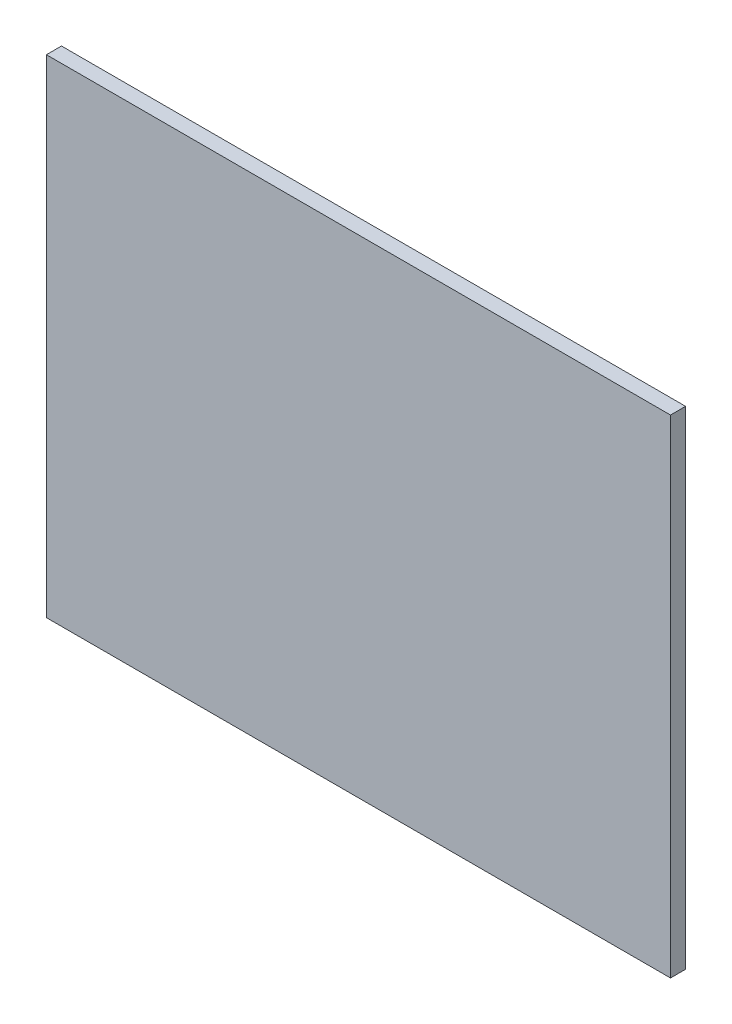
ISO-10303-21;
HEADER;
FILE_DESCRIPTION(('STEP AP214'),'2;1');
FILE_NAME('part.step','',(''),(''),'','','');
FILE_SCHEMA(('AUTOMOTIVE_DESIGN { 1 0 10303 214 1 1 1 1 }'));
ENDSEC;
DATA;
#1=APPLICATION_CONTEXT('core data for automotive mechanical design processes');
#2=APPLICATION_PROTOCOL_DEFINITION('international standard','automotive_design',2000,#1);
#3=PRODUCT_CONTEXT('',#1,'mechanical');
#4=PRODUCT('Part','Part','',(#3));
#5=PRODUCT_RELATED_PRODUCT_CATEGORY('part','',(#4));
#6=PRODUCT_DEFINITION_FORMATION('','',#4);
#7=PRODUCT_DEFINITION_CONTEXT('part definition',#1,'design');
#8=PRODUCT_DEFINITION('design','',#6,#7);
#9=PRODUCT_DEFINITION_SHAPE('','',#8);
#10=(LENGTH_UNIT() NAMED_UNIT(*) SI_UNIT(.MILLI.,.METRE.));
#11=(NAMED_UNIT(*) PLANE_ANGLE_UNIT() SI_UNIT($,.RADIAN.));
#12=(NAMED_UNIT(*) SI_UNIT($,.STERADIAN.) SOLID_ANGLE_UNIT());
#13=UNCERTAINTY_MEASURE_WITH_UNIT(LENGTH_MEASURE(1.E-05),#10,'distance_accuracy_value','');
#14=(GEOMETRIC_REPRESENTATION_CONTEXT(3) GLOBAL_UNCERTAINTY_ASSIGNED_CONTEXT((#13)) GLOBAL_UNIT_ASSIGNED_CONTEXT((#10,
#11,#12)) REPRESENTATION_CONTEXT('',''));
#15=CARTESIAN_POINT('',(0.,0.,0.));
#16=DIRECTION('',(0.,0.,1.));
#17=DIRECTION('',(1.,0.,0.));
#18=AXIS2_PLACEMENT_3D('',#15,#16,#17);
#19=CARTESIAN_POINT('',(-372.5,-291.,18.));
#20=DIRECTION('',(1.,0.,0.));
#21=DIRECTION('',(0.,0.,-1.));
#22=AXIS2_PLACEMENT_3D('',#19,#20,#21);
#23=PLANE('',#22);
#24=DIRECTION('',(0.,-1.,0.));
#25=VECTOR('',#24,1.);
#26=CARTESIAN_POINT('',(-372.5,-291.,0.));
#27=LINE('',#26,#25);
#28=CARTESIAN_POINT('',(-372.5,291.,0.));
#29=VERTEX_POINT('',#28);
#30=CARTESIAN_POINT('',(-372.5,-291.,0.));
#31=VERTEX_POINT('',#30);
#32=EDGE_CURVE('E96',#29,#31,#27,.T.);
#33=ORIENTED_EDGE('',*,*,#32,.T.);
#34=DIRECTION('',(0.,0.,-1.));
#35=VECTOR('',#34,1.);
#36=CARTESIAN_POINT('',(-372.5,-291.,18.));
#37=LINE('',#36,#35);
#38=CARTESIAN_POINT('',(-372.5,-291.,18.));
#39=VERTEX_POINT('',#38);
#40=EDGE_CURVE('E11',#39,#31,#37,.T.);
#41=ORIENTED_EDGE('',*,*,#40,.F.);
#42=DIRECTION('',(0.,-1.,0.));
#43=VECTOR('',#42,1.);
#44=CARTESIAN_POINT('',(-372.5,-291.,18.));
#45=LINE('',#44,#43);
#46=CARTESIAN_POINT('',(-372.5,291.,18.));
#47=VERTEX_POINT('',#46);
#48=EDGE_CURVE('E84',#47,#39,#45,.T.);
#49=ORIENTED_EDGE('',*,*,#48,.F.);
#50=DIRECTION('',(0.,0.,-1.));
#51=VECTOR('',#50,1.);
#52=CARTESIAN_POINT('',(-372.5,291.,18.));
#53=LINE('',#52,#51);
#54=EDGE_CURVE('E92',#47,#29,#53,.T.);
#55=ORIENTED_EDGE('',*,*,#54,.T.);
#56=EDGE_LOOP('',(#33,#41,#49,#55));
#57=FACE_BOUND('',#56,.T.);
#58=ADVANCED_FACE('F33',(#57),#23,.F.);
#59=CARTESIAN_POINT('',(372.5,-291.,18.));
#60=DIRECTION('',(0.,1.,0.));
#61=DIRECTION('',(-1.,0.,0.));
#62=AXIS2_PLACEMENT_3D('',#59,#60,#61);
#63=PLANE('',#62);
#64=DIRECTION('',(1.,0.,0.));
#65=VECTOR('',#64,1.);
#66=CARTESIAN_POINT('',(372.5,-291.,0.));
#67=LINE('',#66,#65);
#68=CARTESIAN_POINT('',(372.5,-291.,0.));
#69=VERTEX_POINT('',#68);
#70=EDGE_CURVE('E88',#31,#69,#67,.T.);
#71=ORIENTED_EDGE('',*,*,#70,.T.);
#72=DIRECTION('',(0.,0.,-1.));
#73=VECTOR('',#72,1.);
#74=CARTESIAN_POINT('',(372.5,-291.,18.));
#75=LINE('',#74,#73);
#76=CARTESIAN_POINT('',(372.5,-291.,18.));
#77=VERTEX_POINT('',#76);
#78=EDGE_CURVE('E41',#77,#69,#75,.T.);
#79=ORIENTED_EDGE('',*,*,#78,.F.);
#80=DIRECTION('',(1.,0.,0.));
#81=VECTOR('',#80,1.);
#82=CARTESIAN_POINT('',(372.5,-291.,18.));
#83=LINE('',#82,#81);
#84=EDGE_CURVE('E79',#39,#77,#83,.T.);
#85=ORIENTED_EDGE('',*,*,#84,.F.);
#86=ORIENTED_EDGE('',*,*,#40,.T.);
#87=EDGE_LOOP('',(#71,#79,#85,#86));
#88=FACE_BOUND('',#87,.T.);
#89=ADVANCED_FACE('F87',(#88),#63,.F.);
#90=CARTESIAN_POINT('',(372.5,-291.,18.));
#91=DIRECTION('',(-1.,0.,0.));
#92=DIRECTION('',(0.,0.,1.));
#93=AXIS2_PLACEMENT_3D('',#90,#91,#92);
#94=PLANE('',#93);
#95=DIRECTION('',(0.,1.,0.));
#96=VECTOR('',#95,1.);
#97=CARTESIAN_POINT('',(372.5,-291.,0.));
#98=LINE('',#97,#96);
#99=CARTESIAN_POINT('',(372.5,291.,0.));
#100=VERTEX_POINT('',#99);
#101=EDGE_CURVE('E66',#69,#100,#98,.T.);
#102=ORIENTED_EDGE('',*,*,#101,.T.);
#103=DIRECTION('',(0.,0.,-1.));
#104=VECTOR('',#103,1.);
#105=CARTESIAN_POINT('',(372.5,291.,18.));
#106=LINE('',#105,#104);
#107=CARTESIAN_POINT('',(372.5,291.,18.));
#108=VERTEX_POINT('',#107);
#109=EDGE_CURVE('E89',#108,#100,#106,.T.);
#110=ORIENTED_EDGE('',*,*,#109,.F.);
#111=DIRECTION('',(0.,1.,0.));
#112=VECTOR('',#111,1.);
#113=CARTESIAN_POINT('',(372.5,-291.,18.));
#114=LINE('',#113,#112);
#115=EDGE_CURVE('E82',#77,#108,#114,.T.);
#116=ORIENTED_EDGE('',*,*,#115,.F.);
#117=ORIENTED_EDGE('',*,*,#78,.T.);
#118=EDGE_LOOP('',(#102,#110,#116,#117));
#119=FACE_BOUND('',#118,.T.);
#120=ADVANCED_FACE('F90',(#119),#94,.F.);
#121=CARTESIAN_POINT('',(372.5,291.,18.));
#122=DIRECTION('',(0.,-1.,0.));
#123=DIRECTION('',(1.,0.,0.));
#124=AXIS2_PLACEMENT_3D('',#121,#122,#123);
#125=PLANE('',#124);
#126=DIRECTION('',(-1.,0.,0.));
#127=VECTOR('',#126,1.);
#128=CARTESIAN_POINT('',(372.5,291.,0.));
#129=LINE('',#128,#127);
#130=EDGE_CURVE('E72',#100,#29,#129,.T.);
#131=ORIENTED_EDGE('',*,*,#130,.T.);
#132=ORIENTED_EDGE('',*,*,#54,.F.);
#133=DIRECTION('',(-1.,0.,0.));
#134=VECTOR('',#133,1.);
#135=CARTESIAN_POINT('',(372.5,291.,18.));
#136=LINE('',#135,#134);
#137=EDGE_CURVE('E49',#108,#47,#136,.T.);
#138=ORIENTED_EDGE('',*,*,#137,.F.);
#139=ORIENTED_EDGE('',*,*,#109,.T.);
#140=EDGE_LOOP('',(#131,#132,#138,#139));
#141=FACE_BOUND('',#140,.T.);
#142=ADVANCED_FACE('F103',(#141),#125,.F.);
#143=CARTESIAN_POINT('',(0.,0.,18.));
#144=DIRECTION('',(0.,0.,1.));
#145=DIRECTION('',(1.,0.,0.));
#146=AXIS2_PLACEMENT_3D('',#143,#144,#145);
#147=PLANE('',#146);
#148=ORIENTED_EDGE('',*,*,#48,.T.);
#149=ORIENTED_EDGE('',*,*,#84,.T.);
#150=ORIENTED_EDGE('',*,*,#115,.T.);
#151=ORIENTED_EDGE('',*,*,#137,.T.);
#152=EDGE_LOOP('',(#148,#149,#150,#151));
#153=FACE_BOUND('',#152,.T.);
#154=ADVANCED_FACE('F80',(#153),#147,.T.);
#155=CARTESIAN_POINT('',(0.,0.,0.));
#156=DIRECTION('',(0.,0.,1.));
#157=DIRECTION('',(1.,0.,0.));
#158=AXIS2_PLACEMENT_3D('',#155,#156,#157);
#159=PLANE('',#158);
#160=ORIENTED_EDGE('',*,*,#32,.F.);
#161=ORIENTED_EDGE('',*,*,#130,.F.);
#162=ORIENTED_EDGE('',*,*,#101,.F.);
#163=ORIENTED_EDGE('',*,*,#70,.F.);
#164=EDGE_LOOP('',(#160,#161,#162,#163));
#165=FACE_BOUND('',#164,.T.);
#166=ADVANCED_FACE('F106',(#165),#159,.F.);
#167=CLOSED_SHELL('',(#58,#89,#120,#142,#154,#166));
#168=MANIFOLD_SOLID_BREP('B2',#167);
#169=ADVANCED_BREP_SHAPE_REPRESENTATION('',(#18,#168),#14);
#170=SHAPE_DEFINITION_REPRESENTATION(#9,#169);
ENDSEC;
END-ISO-10303-21;
